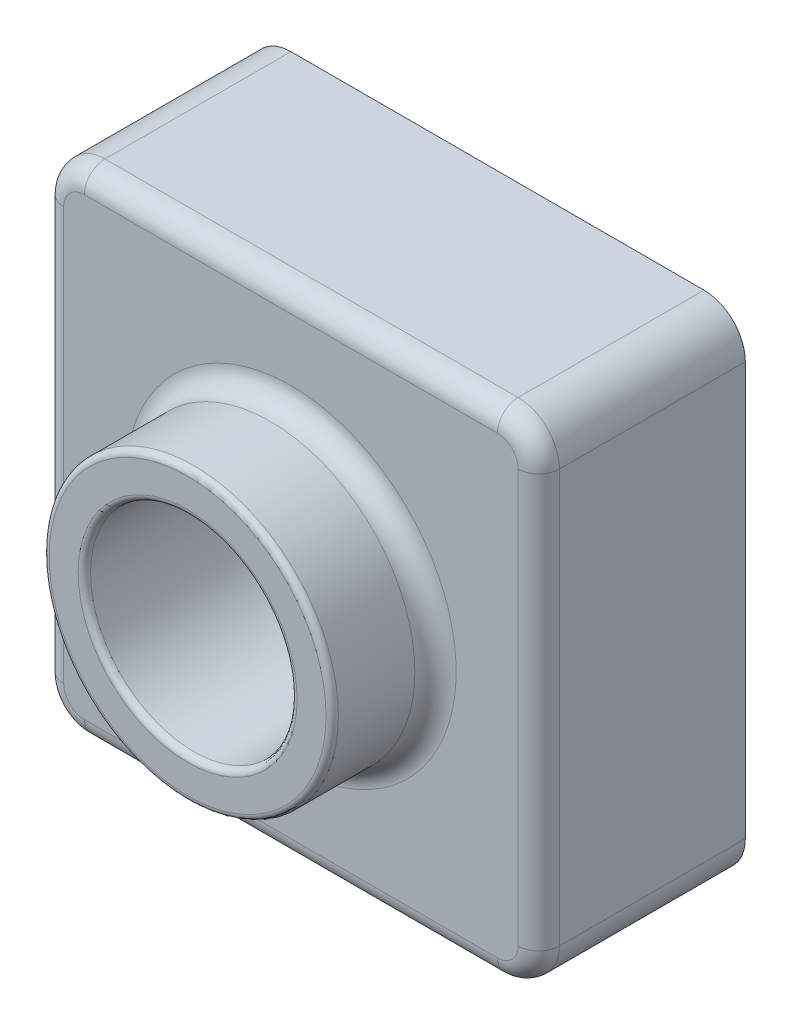
ISO-10303-21;
HEADER;
FILE_DESCRIPTION(('STEP AP214'),'2;1');
FILE_NAME('part.step','',(''),(''),'','','');
FILE_SCHEMA(('AUTOMOTIVE_DESIGN { 1 0 10303 214 1 1 1 1 }'));
ENDSEC;
DATA;
#1=APPLICATION_CONTEXT('core data for automotive mechanical design processes');
#2=APPLICATION_PROTOCOL_DEFINITION('international standard','automotive_design',2000,#1);
#3=PRODUCT_CONTEXT('',#1,'mechanical');
#4=PRODUCT('Part','Part','',(#3));
#5=PRODUCT_RELATED_PRODUCT_CATEGORY('part','',(#4));
#6=PRODUCT_DEFINITION_FORMATION('','',#4);
#7=PRODUCT_DEFINITION_CONTEXT('part definition',#1,'design');
#8=PRODUCT_DEFINITION('design','',#6,#7);
#9=PRODUCT_DEFINITION_SHAPE('','',#8);
#10=(LENGTH_UNIT() NAMED_UNIT(*) SI_UNIT(.MILLI.,.METRE.));
#11=(NAMED_UNIT(*) PLANE_ANGLE_UNIT() SI_UNIT($,.RADIAN.));
#12=(NAMED_UNIT(*) SI_UNIT($,.STERADIAN.) SOLID_ANGLE_UNIT());
#13=UNCERTAINTY_MEASURE_WITH_UNIT(LENGTH_MEASURE(1.E-05),#10,'distance_accuracy_value','');
#14=(GEOMETRIC_REPRESENTATION_CONTEXT(3) GLOBAL_UNCERTAINTY_ASSIGNED_CONTEXT((#13)) GLOBAL_UNIT_ASSIGNED_CONTEXT((#10,
#11,#12)) REPRESENTATION_CONTEXT('',''));
#15=CARTESIAN_POINT('',(0.,0.,0.));
#16=DIRECTION('',(0.,0.,1.));
#17=DIRECTION('',(1.,0.,0.));
#18=AXIS2_PLACEMENT_3D('',#15,#16,#17);
#19=CARTESIAN_POINT('',(0.,0.,0.));
#20=DIRECTION('',(0.,0.,-1.));
#21=DIRECTION('',(-1.,0.,0.));
#22=AXIS2_PLACEMENT_3D('',#19,#20,#21);
#23=PLANE('',#22);
#24=DIRECTION('',(1.,0.,0.));
#25=VECTOR('',#24,1.);
#26=CARTESIAN_POINT('',(0.,0.,0.));
#27=LINE('',#26,#25);
#28=CARTESIAN_POINT('',(10.,0.,0.));
#29=VERTEX_POINT('',#28);
#30=CARTESIAN_POINT('',(110.,0.,0.));
#31=VERTEX_POINT('',#30);
#32=EDGE_CURVE('E299',#29,#31,#27,.T.);
#33=ORIENTED_EDGE('',*,*,#32,.F.);
#34=CARTESIAN_POINT('',(10.,10.,0.));
#35=DIRECTION('',(0.,0.,-1.));
#36=DIRECTION('',(-1.,0.,0.));
#37=AXIS2_PLACEMENT_3D('',#34,#35,#36);
#38=CIRCLE('',#37,10.);
#39=CARTESIAN_POINT('',(0.,10.,0.));
#40=VERTEX_POINT('',#39);
#41=EDGE_CURVE('E326',#29,#40,#38,.T.);
#42=ORIENTED_EDGE('',*,*,#41,.T.);
#43=DIRECTION('',(0.,-1.,0.));
#44=VECTOR('',#43,1.);
#45=CARTESIAN_POINT('',(0.,0.,0.));
#46=LINE('',#45,#44);
#47=CARTESIAN_POINT('',(0.,110.,0.));
#48=VERTEX_POINT('',#47);
#49=EDGE_CURVE('E295',#48,#40,#46,.T.);
#50=ORIENTED_EDGE('',*,*,#49,.F.);
#51=CARTESIAN_POINT('',(9.99999999999996,110.,0.));
#52=DIRECTION('',(0.,0.,-1.));
#53=DIRECTION('',(-1.,0.,0.));
#54=AXIS2_PLACEMENT_3D('',#51,#52,#53);
#55=CIRCLE('',#54,10.);
#56=CARTESIAN_POINT('',(9.99999999999996,120.,0.));
#57=VERTEX_POINT('',#56);
#58=EDGE_CURVE('E323',#48,#57,#55,.T.);
#59=ORIENTED_EDGE('',*,*,#58,.T.);
#60=DIRECTION('',(-1.,0.,0.));
#61=VECTOR('',#60,1.);
#62=CARTESIAN_POINT('',(0.,120.,0.));
#63=LINE('',#62,#61);
#64=CARTESIAN_POINT('',(110.,120.,0.));
#65=VERTEX_POINT('',#64);
#66=EDGE_CURVE('E307',#65,#57,#63,.T.);
#67=ORIENTED_EDGE('',*,*,#66,.F.);
#68=CARTESIAN_POINT('',(110.,110.,0.));
#69=DIRECTION('',(0.,0.,-1.));
#70=DIRECTION('',(-1.,0.,0.));
#71=AXIS2_PLACEMENT_3D('',#68,#69,#70);
#72=CIRCLE('',#71,10.);
#73=CARTESIAN_POINT('',(120.,110.,0.));
#74=VERTEX_POINT('',#73);
#75=EDGE_CURVE('E317',#65,#74,#72,.T.);
#76=ORIENTED_EDGE('',*,*,#75,.T.);
#77=DIRECTION('',(0.,1.,0.));
#78=VECTOR('',#77,1.);
#79=CARTESIAN_POINT('',(120.,0.,0.));
#80=LINE('',#79,#78);
#81=CARTESIAN_POINT('',(120.,10.,0.));
#82=VERTEX_POINT('',#81);
#83=EDGE_CURVE('E303',#82,#74,#80,.T.);
#84=ORIENTED_EDGE('',*,*,#83,.F.);
#85=CARTESIAN_POINT('',(110.,10.,0.));
#86=DIRECTION('',(0.,0.,-1.));
#87=DIRECTION('',(-1.,0.,0.));
#88=AXIS2_PLACEMENT_3D('',#85,#86,#87);
#89=CIRCLE('',#88,10.);
#90=EDGE_CURVE('E320',#82,#31,#89,.T.);
#91=ORIENTED_EDGE('',*,*,#90,.T.);
#92=EDGE_LOOP('',(#33,#42,#50,#59,#67,#76,#84,#91));
#93=FACE_BOUND('',#92,.T.);
#94=CARTESIAN_POINT('',(10.,10.,0.));
#95=DIRECTION('',(0.,0.,-1.));
#96=DIRECTION('',(-1.,0.,0.));
#97=AXIS2_PLACEMENT_3D('',#94,#95,#96);
#98=CIRCLE('',#97,8.);
#99=CARTESIAN_POINT('',(10.,2.,0.));
#100=VERTEX_POINT('',#99);
#101=CARTESIAN_POINT('',(2.,10.,0.));
#102=VERTEX_POINT('',#101);
#103=EDGE_CURVE('E189',#100,#102,#98,.T.);
#104=ORIENTED_EDGE('',*,*,#103,.F.);
#105=DIRECTION('',(1.,0.,0.));
#106=VECTOR('',#105,1.);
#107=CARTESIAN_POINT('',(0.,2.,0.));
#108=LINE('',#107,#106);
#109=CARTESIAN_POINT('',(110.,2.,0.));
#110=VERTEX_POINT('',#109);
#111=EDGE_CURVE('E268',#100,#110,#108,.T.);
#112=ORIENTED_EDGE('',*,*,#111,.T.);
#113=CARTESIAN_POINT('',(110.,10.,0.));
#114=DIRECTION('',(0.,0.,-1.));
#115=DIRECTION('',(-1.,0.,0.));
#116=AXIS2_PLACEMENT_3D('',#113,#114,#115);
#117=CIRCLE('',#116,8.);
#118=CARTESIAN_POINT('',(118.,10.,0.));
#119=VERTEX_POINT('',#118);
#120=EDGE_CURVE('E272',#119,#110,#117,.T.);
#121=ORIENTED_EDGE('',*,*,#120,.F.);
#122=DIRECTION('',(0.,1.,0.));
#123=VECTOR('',#122,1.);
#124=CARTESIAN_POINT('',(118.,0.,0.));
#125=LINE('',#124,#123);
#126=CARTESIAN_POINT('',(118.,110.,0.));
#127=VERTEX_POINT('',#126);
#128=EDGE_CURVE('E276',#119,#127,#125,.T.);
#129=ORIENTED_EDGE('',*,*,#128,.T.);
#130=CARTESIAN_POINT('',(110.,110.,0.));
#131=DIRECTION('',(0.,0.,-1.));
#132=DIRECTION('',(-1.,0.,0.));
#133=AXIS2_PLACEMENT_3D('',#130,#131,#132);
#134=CIRCLE('',#133,8.);
#135=CARTESIAN_POINT('',(110.,118.,0.));
#136=VERTEX_POINT('',#135);
#137=EDGE_CURVE('E242',#136,#127,#134,.T.);
#138=ORIENTED_EDGE('',*,*,#137,.F.);
#139=DIRECTION('',(-1.,0.,0.));
#140=VECTOR('',#139,1.);
#141=CARTESIAN_POINT('',(0.,118.,0.));
#142=LINE('',#141,#140);
#143=CARTESIAN_POINT('',(9.99999999999996,118.,0.));
#144=VERTEX_POINT('',#143);
#145=EDGE_CURVE('E205',#136,#144,#142,.T.);
#146=ORIENTED_EDGE('',*,*,#145,.T.);
#147=CARTESIAN_POINT('',(9.99999999999996,110.,0.));
#148=DIRECTION('',(0.,0.,-1.));
#149=DIRECTION('',(-1.,0.,0.));
#150=AXIS2_PLACEMENT_3D('',#147,#148,#149);
#151=CIRCLE('',#150,8.);
#152=CARTESIAN_POINT('',(1.99999999999996,110.,0.));
#153=VERTEX_POINT('',#152);
#154=EDGE_CURVE('E269',#153,#144,#151,.T.);
#155=ORIENTED_EDGE('',*,*,#154,.F.);
#156=DIRECTION('',(0.,-1.,0.));
#157=VECTOR('',#156,1.);
#158=CARTESIAN_POINT('',(2.,0.,0.));
#159=LINE('',#158,#157);
#160=EDGE_CURVE('E260',#153,#102,#159,.T.);
#161=ORIENTED_EDGE('',*,*,#160,.T.);
#162=EDGE_LOOP('',(#104,#112,#121,#129,#138,#146,#155,#161));
#163=FACE_BOUND('',#162,.T.);
#164=ADVANCED_FACE('F41',(#93,#163),#23,.T.);
#165=CARTESIAN_POINT('',(0.,0.,50.));
#166=DIRECTION('',(1.,0.,0.));
#167=DIRECTION('',(0.,1.,0.));
#168=AXIS2_PLACEMENT_3D('',#165,#166,#167);
#169=PLANE('',#168);
#170=DIRECTION('',(0.,0.,-1.));
#171=VECTOR('',#170,1.);
#172=CARTESIAN_POINT('',(0.,10.,50.));
#173=LINE('',#172,#171);
#174=CARTESIAN_POINT('',(0.,10.,45.));
#175=VERTEX_POINT('',#174);
#176=EDGE_CURVE('E332',#40,#175,#173,.F.);
#177=ORIENTED_EDGE('',*,*,#176,.T.);
#178=DIRECTION('',(0.,-1.,0.));
#179=VECTOR('',#178,1.);
#180=CARTESIAN_POINT('',(0.,0.,45.));
#181=LINE('',#180,#179);
#182=CARTESIAN_POINT('',(0.,110.,45.));
#183=VERTEX_POINT('',#182);
#184=EDGE_CURVE('E51',#175,#183,#181,.F.);
#185=ORIENTED_EDGE('',*,*,#184,.T.);
#186=DIRECTION('',(0.,0.,-1.));
#187=VECTOR('',#186,1.);
#188=CARTESIAN_POINT('',(0.,110.,50.));
#189=LINE('',#188,#187);
#190=EDGE_CURVE('E329',#183,#48,#189,.T.);
#191=ORIENTED_EDGE('',*,*,#190,.T.);
#192=ORIENTED_EDGE('',*,*,#49,.T.);
#193=EDGE_LOOP('',(#177,#185,#191,#192));
#194=FACE_BOUND('',#193,.T.);
#195=ADVANCED_FACE('F502',(#194),#169,.F.);
#196=CARTESIAN_POINT('',(0.,0.,50.));
#197=DIRECTION('',(0.,1.,0.));
#198=DIRECTION('',(0.,0.,1.));
#199=AXIS2_PLACEMENT_3D('',#196,#197,#198);
#200=PLANE('',#199);
#201=DIRECTION('',(0.,0.,-1.));
#202=VECTOR('',#201,1.);
#203=CARTESIAN_POINT('',(110.,0.,50.));
#204=LINE('',#203,#202);
#205=CARTESIAN_POINT('',(110.,0.,45.));
#206=VERTEX_POINT('',#205);
#207=EDGE_CURVE('E311',#31,#206,#204,.F.);
#208=ORIENTED_EDGE('',*,*,#207,.T.);
#209=DIRECTION('',(1.,0.,0.));
#210=VECTOR('',#209,1.);
#211=CARTESIAN_POINT('',(0.,0.,45.));
#212=LINE('',#211,#210);
#213=CARTESIAN_POINT('',(10.,0.,45.));
#214=VERTEX_POINT('',#213);
#215=EDGE_CURVE('E67',#206,#214,#212,.F.);
#216=ORIENTED_EDGE('',*,*,#215,.T.);
#217=DIRECTION('',(0.,0.,-1.));
#218=VECTOR('',#217,1.);
#219=CARTESIAN_POINT('',(10.,0.,50.));
#220=LINE('',#219,#218);
#221=EDGE_CURVE('E314',#214,#29,#220,.T.);
#222=ORIENTED_EDGE('',*,*,#221,.T.);
#223=ORIENTED_EDGE('',*,*,#32,.T.);
#224=EDGE_LOOP('',(#208,#216,#222,#223));
#225=FACE_BOUND('',#224,.T.);
#226=ADVANCED_FACE('F460',(#225),#200,.F.);
#227=CARTESIAN_POINT('',(120.,0.,50.));
#228=DIRECTION('',(-1.,0.,0.));
#229=DIRECTION('',(0.,-1.,0.));
#230=AXIS2_PLACEMENT_3D('',#227,#228,#229);
#231=PLANE('',#230);
#232=DIRECTION('',(0.,0.,-1.));
#233=VECTOR('',#232,1.);
#234=CARTESIAN_POINT('',(120.,110.,50.));
#235=LINE('',#234,#233);
#236=CARTESIAN_POINT('',(120.,110.,45.));
#237=VERTEX_POINT('',#236);
#238=EDGE_CURVE('E342',#74,#237,#235,.F.);
#239=ORIENTED_EDGE('',*,*,#238,.T.);
#240=DIRECTION('',(0.,1.,0.));
#241=VECTOR('',#240,1.);
#242=CARTESIAN_POINT('',(120.,0.,45.));
#243=LINE('',#242,#241);
#244=CARTESIAN_POINT('',(120.,10.,45.));
#245=VERTEX_POINT('',#244);
#246=EDGE_CURVE('E404',#237,#245,#243,.F.);
#247=ORIENTED_EDGE('',*,*,#246,.T.);
#248=DIRECTION('',(0.,0.,-1.));
#249=VECTOR('',#248,1.);
#250=CARTESIAN_POINT('',(120.,10.,50.));
#251=LINE('',#250,#249);
#252=EDGE_CURVE('E346',#245,#82,#251,.T.);
#253=ORIENTED_EDGE('',*,*,#252,.T.);
#254=ORIENTED_EDGE('',*,*,#83,.T.);
#255=EDGE_LOOP('',(#239,#247,#253,#254));
#256=FACE_BOUND('',#255,.T.);
#257=ADVANCED_FACE('F471',(#256),#231,.F.);
#258=CARTESIAN_POINT('',(0.,120.,50.));
#259=DIRECTION('',(0.,-1.,0.));
#260=DIRECTION('',(0.,0.,-1.));
#261=AXIS2_PLACEMENT_3D('',#258,#259,#260);
#262=PLANE('',#261);
#263=DIRECTION('',(0.,0.,-1.));
#264=VECTOR('',#263,1.);
#265=CARTESIAN_POINT('',(9.99999999999996,120.,50.));
#266=LINE('',#265,#264);
#267=CARTESIAN_POINT('',(9.99999999999996,120.,45.));
#268=VERTEX_POINT('',#267);
#269=EDGE_CURVE('E338',#57,#268,#266,.F.);
#270=ORIENTED_EDGE('',*,*,#269,.T.);
#271=DIRECTION('',(-1.,0.,0.));
#272=VECTOR('',#271,1.);
#273=CARTESIAN_POINT('',(0.,120.,45.));
#274=LINE('',#273,#272);
#275=CARTESIAN_POINT('',(110.,120.,45.));
#276=VERTEX_POINT('',#275);
#277=EDGE_CURVE('E398',#268,#276,#274,.F.);
#278=ORIENTED_EDGE('',*,*,#277,.T.);
#279=DIRECTION('',(0.,0.,-1.));
#280=VECTOR('',#279,1.);
#281=CARTESIAN_POINT('',(110.,120.,50.));
#282=LINE('',#281,#280);
#283=EDGE_CURVE('E335',#276,#65,#282,.T.);
#284=ORIENTED_EDGE('',*,*,#283,.T.);
#285=ORIENTED_EDGE('',*,*,#66,.T.);
#286=EDGE_LOOP('',(#270,#278,#284,#285));
#287=FACE_BOUND('',#286,.T.);
#288=ADVANCED_FACE('F538',(#287),#262,.F.);
#289=CARTESIAN_POINT('',(0.,0.,50.));
#290=DIRECTION('',(0.,0.,-1.));
#291=DIRECTION('',(-1.,0.,0.));
#292=AXIS2_PLACEMENT_3D('',#289,#290,#291);
#293=PLANE('',#292);
#294=DIRECTION('',(-1.,0.,0.));
#295=VECTOR('',#294,1.);
#296=CARTESIAN_POINT('',(0.,115.,50.));
#297=LINE('',#296,#295);
#298=CARTESIAN_POINT('',(110.,115.,50.));
#299=VERTEX_POINT('',#298);
#300=CARTESIAN_POINT('',(9.99999999999996,115.,50.));
#301=VERTEX_POINT('',#300);
#302=EDGE_CURVE('E387',#299,#301,#297,.T.);
#303=ORIENTED_EDGE('',*,*,#302,.T.);
#304=CARTESIAN_POINT('',(9.99999999999996,110.,50.));
#305=DIRECTION('',(0.,0.,-1.));
#306=DIRECTION('',(-1.,0.,0.));
#307=AXIS2_PLACEMENT_3D('',#304,#305,#306);
#308=CIRCLE('',#307,5.);
#309=CARTESIAN_POINT('',(4.99999999999996,110.,50.));
#310=VERTEX_POINT('',#309);
#311=EDGE_CURVE('E390',#301,#310,#308,.F.);
#312=ORIENTED_EDGE('',*,*,#311,.T.);
#313=DIRECTION('',(0.,-1.,0.));
#314=VECTOR('',#313,1.);
#315=CARTESIAN_POINT('',(5.,0.,50.));
#316=LINE('',#315,#314);
#317=CARTESIAN_POINT('',(5.,10.,50.));
#318=VERTEX_POINT('',#317);
#319=EDGE_CURVE('E369',#310,#318,#316,.T.);
#320=ORIENTED_EDGE('',*,*,#319,.T.);
#321=CARTESIAN_POINT('',(10.,10.,50.));
#322=DIRECTION('',(0.,0.,-1.));
#323=DIRECTION('',(-1.,0.,0.));
#324=AXIS2_PLACEMENT_3D('',#321,#322,#323);
#325=CIRCLE('',#324,5.);
#326=CARTESIAN_POINT('',(10.,5.,50.));
#327=VERTEX_POINT('',#326);
#328=EDGE_CURVE('E372',#318,#327,#325,.F.);
#329=ORIENTED_EDGE('',*,*,#328,.T.);
#330=DIRECTION('',(1.,0.,0.));
#331=VECTOR('',#330,1.);
#332=CARTESIAN_POINT('',(0.,5.,50.));
#333=LINE('',#332,#331);
#334=CARTESIAN_POINT('',(110.,5.,50.));
#335=VERTEX_POINT('',#334);
#336=EDGE_CURVE('E375',#327,#335,#333,.T.);
#337=ORIENTED_EDGE('',*,*,#336,.T.);
#338=CARTESIAN_POINT('',(110.,10.,50.));
#339=DIRECTION('',(0.,0.,-1.));
#340=DIRECTION('',(-1.,0.,0.));
#341=AXIS2_PLACEMENT_3D('',#338,#339,#340);
#342=CIRCLE('',#341,5.);
#343=CARTESIAN_POINT('',(115.,10.,50.));
#344=VERTEX_POINT('',#343);
#345=EDGE_CURVE('E378',#335,#344,#342,.F.);
#346=ORIENTED_EDGE('',*,*,#345,.T.);
#347=DIRECTION('',(0.,1.,0.));
#348=VECTOR('',#347,1.);
#349=CARTESIAN_POINT('',(115.,0.,50.));
#350=LINE('',#349,#348);
#351=CARTESIAN_POINT('',(115.,110.,50.));
#352=VERTEX_POINT('',#351);
#353=EDGE_CURVE('E381',#344,#352,#350,.T.);
#354=ORIENTED_EDGE('',*,*,#353,.T.);
#355=CARTESIAN_POINT('',(110.,110.,50.));
#356=DIRECTION('',(0.,0.,-1.));
#357=DIRECTION('',(-1.,0.,0.));
#358=AXIS2_PLACEMENT_3D('',#355,#356,#357);
#359=CIRCLE('',#358,5.);
#360=EDGE_CURVE('E384',#352,#299,#359,.F.);
#361=ORIENTED_EDGE('',*,*,#360,.T.);
#362=EDGE_LOOP('',(#303,#312,#320,#329,#337,#346,#354,#361));
#363=FACE_BOUND('',#362,.T.);
#364=CARTESIAN_POINT('',(60.,60.,50.));
#365=DIRECTION('',(0.,0.,-1.));
#366=DIRECTION('',(-1.,0.,0.));
#367=AXIS2_PLACEMENT_3D('',#364,#365,#366);
#368=CIRCLE('',#367,40.);
#369=CARTESIAN_POINT('',(20.,60.,50.));
#370=VERTEX_POINT('',#369);
#371=EDGE_CURVE('E365',#370,#370,#368,.T.);
#372=ORIENTED_EDGE('',*,*,#371,.T.);
#373=EDGE_LOOP('',(#372));
#374=FACE_BOUND('',#373,.T.);
#375=ADVANCED_FACE('F487',(#363,#374),#293,.F.);
#376=CARTESIAN_POINT('',(60.,60.,0.));
#377=DIRECTION('',(0.,0.,-1.));
#378=DIRECTION('',(-1.,0.,0.));
#379=AXIS2_PLACEMENT_3D('',#376,#377,#378);
#380=CIRCLE('',#379,27.);
#381=CARTESIAN_POINT('',(33.,60.,0.));
#382=VERTEX_POINT('',#381);
#383=EDGE_CURVE('E261',#382,#382,#380,.F.);
#384=ORIENTED_EDGE('',*,*,#383,.F.);
#385=EDGE_LOOP('',(#384));
#386=FACE_BOUND('',#385,.T.);
#387=CARTESIAN_POINT('',(60.,60.,0.));
#388=DIRECTION('',(0.,0.,1.));
#389=DIRECTION('',(1.,0.,0.));
#390=AXIS2_PLACEMENT_3D('',#387,#388,#389);
#391=CIRCLE('',#390,25.);
#392=CARTESIAN_POINT('',(85.,60.,0.));
#393=VERTEX_POINT('',#392);
#394=EDGE_CURVE('E250',#393,#393,#391,.T.);
#395=ORIENTED_EDGE('',*,*,#394,.T.);
#396=EDGE_LOOP('',(#395));
#397=FACE_BOUND('',#396,.T.);
#398=ADVANCED_FACE('F521',(#386,#397),#23,.T.);
#399=CARTESIAN_POINT('',(60.,60.,75.));
#400=DIRECTION('',(0.,0.,-1.));
#401=DIRECTION('',(-1.,0.,0.));
#402=AXIS2_PLACEMENT_3D('',#399,#400,#401);
#403=CYLINDRICAL_SURFACE('',#402,35.);
#404=CARTESIAN_POINT('',(60.,60.,55.));
#405=DIRECTION('',(0.,0.,-1.));
#406=DIRECTION('',(-1.,0.,0.));
#407=AXIS2_PLACEMENT_3D('',#404,#405,#406);
#408=CIRCLE('',#407,35.);
#409=CARTESIAN_POINT('',(25.,60.,55.));
#410=VERTEX_POINT('',#409);
#411=EDGE_CURVE('E11',#410,#410,#408,.F.);
#412=ORIENTED_EDGE('',*,*,#411,.T.);
#413=EDGE_LOOP('',(#412));
#414=FACE_BOUND('',#413,.T.);
#415=CARTESIAN_POINT('',(60.,60.,73.5));
#416=DIRECTION('',(0.,0.,1.));
#417=DIRECTION('',(1.,0.,0.));
#418=AXIS2_PLACEMENT_3D('',#415,#416,#417);
#419=CIRCLE('',#418,35.);
#420=CARTESIAN_POINT('',(95.,60.,73.5));
#421=VERTEX_POINT('',#420);
#422=EDGE_CURVE('E361',#421,#421,#419,.F.);
#423=ORIENTED_EDGE('',*,*,#422,.T.);
#424=EDGE_LOOP('',(#423));
#425=FACE_BOUND('',#424,.T.);
#426=ADVANCED_FACE('F529',(#414,#425),#403,.T.);
#427=CARTESIAN_POINT('',(60.,60.,75.));
#428=DIRECTION('',(0.,0.,1.));
#429=DIRECTION('',(1.,0.,0.));
#430=AXIS2_PLACEMENT_3D('',#427,#428,#429);
#431=PLANE('',#430);
#432=CARTESIAN_POINT('',(60.,60.,75.));
#433=DIRECTION('',(0.,0.,1.));
#434=DIRECTION('',(1.,0.,0.));
#435=AXIS2_PLACEMENT_3D('',#432,#433,#434);
#436=CIRCLE('',#435,26.5);
#437=CARTESIAN_POINT('',(86.5,60.,75.));
#438=VERTEX_POINT('',#437);
#439=EDGE_CURVE('E357',#438,#438,#436,.F.);
#440=ORIENTED_EDGE('',*,*,#439,.T.);
#441=EDGE_LOOP('',(#440));
#442=FACE_BOUND('',#441,.T.);
#443=CARTESIAN_POINT('',(60.,60.,75.));
#444=DIRECTION('',(0.,0.,1.));
#445=DIRECTION('',(1.,0.,0.));
#446=AXIS2_PLACEMENT_3D('',#443,#444,#445);
#447=CIRCLE('',#446,33.5);
#448=CARTESIAN_POINT('',(93.5,60.,75.));
#449=VERTEX_POINT('',#448);
#450=EDGE_CURVE('E353',#449,#449,#447,.T.);
#451=ORIENTED_EDGE('',*,*,#450,.T.);
#452=EDGE_LOOP('',(#451));
#453=FACE_BOUND('',#452,.T.);
#454=ADVANCED_FACE('F535',(#442,#453),#431,.T.);
#455=CARTESIAN_POINT('',(60.,60.,0.));
#456=DIRECTION('',(0.,0.,1.));
#457=DIRECTION('',(1.,0.,0.));
#458=AXIS2_PLACEMENT_3D('',#455,#456,#457);
#459=CYLINDRICAL_SURFACE('',#458,25.);
#460=CARTESIAN_POINT('',(60.,60.,73.5));
#461=DIRECTION('',(0.,0.,1.));
#462=DIRECTION('',(1.,0.,0.));
#463=AXIS2_PLACEMENT_3D('',#460,#461,#462);
#464=CIRCLE('',#463,25.);
#465=CARTESIAN_POINT('',(85.,60.,73.5));
#466=VERTEX_POINT('',#465);
#467=EDGE_CURVE('E349',#466,#466,#464,.T.);
#468=ORIENTED_EDGE('',*,*,#467,.T.);
#469=EDGE_LOOP('',(#468));
#470=FACE_BOUND('',#469,.T.);
#471=ORIENTED_EDGE('',*,*,#394,.F.);
#472=EDGE_LOOP('',(#471));
#473=FACE_BOUND('',#472,.T.);
#474=ADVANCED_FACE('F543',(#470,#473),#459,.F.);
#475=CARTESIAN_POINT('',(10.,10.,50.));
#476=DIRECTION('',(0.,0.,-1.));
#477=DIRECTION('',(-1.,0.,0.));
#478=AXIS2_PLACEMENT_3D('',#475,#476,#477);
#479=CYLINDRICAL_SURFACE('',#478,10.);
#480=ORIENTED_EDGE('',*,*,#221,.F.);
#481=CARTESIAN_POINT('',(10.,10.,45.));
#482=DIRECTION('',(0.,0.,-1.));
#483=DIRECTION('',(-1.,0.,0.));
#484=AXIS2_PLACEMENT_3D('',#481,#482,#483);
#485=CIRCLE('',#484,10.);
#486=EDGE_CURVE('E59',#214,#175,#485,.T.);
#487=ORIENTED_EDGE('',*,*,#486,.T.);
#488=ORIENTED_EDGE('',*,*,#176,.F.);
#489=ORIENTED_EDGE('',*,*,#41,.F.);
#490=EDGE_LOOP('',(#480,#487,#488,#489));
#491=FACE_BOUND('',#490,.T.);
#492=ADVANCED_FACE('F545',(#491),#479,.T.);
#493=CARTESIAN_POINT('',(9.99999999999996,110.,50.));
#494=DIRECTION('',(0.,0.,-1.));
#495=DIRECTION('',(-1.,0.,0.));
#496=AXIS2_PLACEMENT_3D('',#493,#494,#495);
#497=CYLINDRICAL_SURFACE('',#496,10.);
#498=ORIENTED_EDGE('',*,*,#190,.F.);
#499=CARTESIAN_POINT('',(9.99999999999996,110.,45.));
#500=DIRECTION('',(0.,0.,-1.));
#501=DIRECTION('',(-1.,0.,0.));
#502=AXIS2_PLACEMENT_3D('',#499,#500,#501);
#503=CIRCLE('',#502,10.);
#504=EDGE_CURVE('E394',#183,#268,#503,.T.);
#505=ORIENTED_EDGE('',*,*,#504,.T.);
#506=ORIENTED_EDGE('',*,*,#269,.F.);
#507=ORIENTED_EDGE('',*,*,#58,.F.);
#508=EDGE_LOOP('',(#498,#505,#506,#507));
#509=FACE_BOUND('',#508,.T.);
#510=ADVANCED_FACE('F506',(#509),#497,.T.);
#511=CARTESIAN_POINT('',(110.,10.,50.));
#512=DIRECTION('',(0.,0.,-1.));
#513=DIRECTION('',(-1.,0.,0.));
#514=AXIS2_PLACEMENT_3D('',#511,#512,#513);
#515=CYLINDRICAL_SURFACE('',#514,10.);
#516=ORIENTED_EDGE('',*,*,#252,.F.);
#517=CARTESIAN_POINT('',(110.,10.,45.));
#518=DIRECTION('',(0.,0.,-1.));
#519=DIRECTION('',(-1.,0.,0.));
#520=AXIS2_PLACEMENT_3D('',#517,#518,#519);
#521=CIRCLE('',#520,10.);
#522=EDGE_CURVE('E407',#245,#206,#521,.T.);
#523=ORIENTED_EDGE('',*,*,#522,.T.);
#524=ORIENTED_EDGE('',*,*,#207,.F.);
#525=ORIENTED_EDGE('',*,*,#90,.F.);
#526=EDGE_LOOP('',(#516,#523,#524,#525));
#527=FACE_BOUND('',#526,.T.);
#528=ADVANCED_FACE('F458',(#527),#515,.T.);
#529=CARTESIAN_POINT('',(110.,110.,50.));
#530=DIRECTION('',(0.,0.,-1.));
#531=DIRECTION('',(-1.,0.,0.));
#532=AXIS2_PLACEMENT_3D('',#529,#530,#531);
#533=CYLINDRICAL_SURFACE('',#532,10.);
#534=ORIENTED_EDGE('',*,*,#283,.F.);
#535=CARTESIAN_POINT('',(110.,110.,45.));
#536=DIRECTION('',(0.,0.,-1.));
#537=DIRECTION('',(-1.,0.,0.));
#538=AXIS2_PLACEMENT_3D('',#535,#536,#537);
#539=CIRCLE('',#538,10.);
#540=EDGE_CURVE('E401',#276,#237,#539,.T.);
#541=ORIENTED_EDGE('',*,*,#540,.T.);
#542=ORIENTED_EDGE('',*,*,#238,.F.);
#543=ORIENTED_EDGE('',*,*,#75,.F.);
#544=EDGE_LOOP('',(#534,#541,#542,#543));
#545=FACE_BOUND('',#544,.T.);
#546=ADVANCED_FACE('F474',(#545),#533,.T.);
#547=CARTESIAN_POINT('',(2.,0.,50.));
#548=DIRECTION('',(1.,0.,0.));
#549=DIRECTION('',(0.,1.,0.));
#550=AXIS2_PLACEMENT_3D('',#547,#548,#549);
#551=PLANE('',#550);
#552=ORIENTED_EDGE('',*,*,#160,.F.);
#553=DIRECTION('',(0.,0.,1.));
#554=VECTOR('',#553,1.);
#555=CARTESIAN_POINT('',(1.99999999999996,110.,50.));
#556=LINE('',#555,#554);
#557=CARTESIAN_POINT('',(1.99999999999996,110.,48.));
#558=VERTEX_POINT('',#557);
#559=EDGE_CURVE('E195',#558,#153,#556,.F.);
#560=ORIENTED_EDGE('',*,*,#559,.F.);
#561=DIRECTION('',(0.,-1.,0.));
#562=VECTOR('',#561,1.);
#563=CARTESIAN_POINT('',(2.,0.,48.));
#564=LINE('',#563,#562);
#565=CARTESIAN_POINT('',(2.,10.,48.));
#566=VERTEX_POINT('',#565);
#567=EDGE_CURVE('E199',#558,#566,#564,.T.);
#568=ORIENTED_EDGE('',*,*,#567,.T.);
#569=DIRECTION('',(0.,0.,1.));
#570=VECTOR('',#569,1.);
#571=CARTESIAN_POINT('',(2.,10.,50.));
#572=LINE('',#571,#570);
#573=EDGE_CURVE('E182',#102,#566,#572,.T.);
#574=ORIENTED_EDGE('',*,*,#573,.F.);
#575=EDGE_LOOP('',(#552,#560,#568,#574));
#576=FACE_BOUND('',#575,.T.);
#577=ADVANCED_FACE('F200',(#576),#551,.T.);
#578=CARTESIAN_POINT('',(0.,2.,50.));
#579=DIRECTION('',(0.,1.,0.));
#580=DIRECTION('',(0.,0.,1.));
#581=AXIS2_PLACEMENT_3D('',#578,#579,#580);
#582=PLANE('',#581);
#583=DIRECTION('',(1.,0.,0.));
#584=VECTOR('',#583,1.);
#585=CARTESIAN_POINT('',(0.,2.,48.));
#586=LINE('',#585,#584);
#587=CARTESIAN_POINT('',(10.,2.,48.));
#588=VERTEX_POINT('',#587);
#589=CARTESIAN_POINT('',(110.,2.,48.));
#590=VERTEX_POINT('',#589);
#591=EDGE_CURVE('E204',#588,#590,#586,.T.);
#592=ORIENTED_EDGE('',*,*,#591,.T.);
#593=DIRECTION('',(0.,0.,1.));
#594=VECTOR('',#593,1.);
#595=CARTESIAN_POINT('',(110.,2.,50.));
#596=LINE('',#595,#594);
#597=EDGE_CURVE('E243',#110,#590,#596,.T.);
#598=ORIENTED_EDGE('',*,*,#597,.F.);
#599=ORIENTED_EDGE('',*,*,#111,.F.);
#600=DIRECTION('',(0.,0.,1.));
#601=VECTOR('',#600,1.);
#602=CARTESIAN_POINT('',(10.,2.,50.));
#603=LINE('',#602,#601);
#604=EDGE_CURVE('E239',#588,#100,#603,.F.);
#605=ORIENTED_EDGE('',*,*,#604,.F.);
#606=EDGE_LOOP('',(#592,#598,#599,#605));
#607=FACE_BOUND('',#606,.T.);
#608=ADVANCED_FACE('F593',(#607),#582,.T.);
#609=CARTESIAN_POINT('',(118.,0.,50.));
#610=DIRECTION('',(-1.,0.,0.));
#611=DIRECTION('',(0.,-1.,0.));
#612=AXIS2_PLACEMENT_3D('',#609,#610,#611);
#613=PLANE('',#612);
#614=DIRECTION('',(0.,1.,0.));
#615=VECTOR('',#614,1.);
#616=CARTESIAN_POINT('',(118.,0.,48.));
#617=LINE('',#616,#615);
#618=CARTESIAN_POINT('',(118.,10.,48.));
#619=VERTEX_POINT('',#618);
#620=CARTESIAN_POINT('',(118.,110.,48.));
#621=VERTEX_POINT('',#620);
#622=EDGE_CURVE('E227',#619,#621,#617,.T.);
#623=ORIENTED_EDGE('',*,*,#622,.T.);
#624=DIRECTION('',(0.,0.,1.));
#625=VECTOR('',#624,1.);
#626=CARTESIAN_POINT('',(118.,110.,50.));
#627=LINE('',#626,#625);
#628=EDGE_CURVE('E251',#127,#621,#627,.T.);
#629=ORIENTED_EDGE('',*,*,#628,.F.);
#630=ORIENTED_EDGE('',*,*,#128,.F.);
#631=DIRECTION('',(0.,0.,1.));
#632=VECTOR('',#631,1.);
#633=CARTESIAN_POINT('',(118.,10.,50.));
#634=LINE('',#633,#632);
#635=EDGE_CURVE('E246',#619,#119,#634,.F.);
#636=ORIENTED_EDGE('',*,*,#635,.F.);
#637=EDGE_LOOP('',(#623,#629,#630,#636));
#638=FACE_BOUND('',#637,.T.);
#639=ADVANCED_FACE('F589',(#638),#613,.T.);
#640=CARTESIAN_POINT('',(0.,118.,50.));
#641=DIRECTION('',(0.,-1.,0.));
#642=DIRECTION('',(0.,0.,-1.));
#643=AXIS2_PLACEMENT_3D('',#640,#641,#642);
#644=PLANE('',#643);
#645=ORIENTED_EDGE('',*,*,#145,.F.);
#646=DIRECTION('',(0.,0.,-1.));
#647=VECTOR('',#646,1.);
#648=CARTESIAN_POINT('',(110.,118.,50.));
#649=LINE('',#648,#647);
#650=CARTESIAN_POINT('',(110.,118.,48.));
#651=VERTEX_POINT('',#650);
#652=EDGE_CURVE('E212',#651,#136,#649,.T.);
#653=ORIENTED_EDGE('',*,*,#652,.F.);
#654=DIRECTION('',(-1.,0.,0.));
#655=VECTOR('',#654,1.);
#656=CARTESIAN_POINT('',(0.,118.,48.));
#657=LINE('',#656,#655);
#658=CARTESIAN_POINT('',(9.99999999999996,118.,48.));
#659=VERTEX_POINT('',#658);
#660=EDGE_CURVE('E233',#651,#659,#657,.T.);
#661=ORIENTED_EDGE('',*,*,#660,.T.);
#662=DIRECTION('',(0.,0.,-1.));
#663=VECTOR('',#662,1.);
#664=CARTESIAN_POINT('',(9.99999999999996,118.,50.));
#665=LINE('',#664,#663);
#666=EDGE_CURVE('E217',#144,#659,#665,.F.);
#667=ORIENTED_EDGE('',*,*,#666,.F.);
#668=EDGE_LOOP('',(#645,#653,#661,#667));
#669=FACE_BOUND('',#668,.T.);
#670=ADVANCED_FACE('F585',(#669),#644,.T.);
#671=CARTESIAN_POINT('',(0.,0.,48.));
#672=DIRECTION('',(0.,0.,-1.));
#673=DIRECTION('',(-1.,0.,0.));
#674=AXIS2_PLACEMENT_3D('',#671,#672,#673);
#675=PLANE('',#674);
#676=CARTESIAN_POINT('',(60.,60.,48.));
#677=DIRECTION('',(0.,0.,-1.));
#678=DIRECTION('',(-1.,0.,0.));
#679=AXIS2_PLACEMENT_3D('',#676,#677,#678);
#680=CIRCLE('',#679,33.);
#681=CARTESIAN_POINT('',(27.,60.,48.));
#682=VERTEX_POINT('',#681);
#683=EDGE_CURVE('E223',#682,#682,#680,.F.);
#684=ORIENTED_EDGE('',*,*,#683,.T.);
#685=EDGE_LOOP('',(#684));
#686=FACE_BOUND('',#685,.T.);
#687=ORIENTED_EDGE('',*,*,#567,.F.);
#688=CARTESIAN_POINT('',(9.99999999999996,110.,48.));
#689=DIRECTION('',(0.,0.,-1.));
#690=DIRECTION('',(-1.,0.,0.));
#691=AXIS2_PLACEMENT_3D('',#688,#689,#690);
#692=CIRCLE('',#691,8.);
#693=EDGE_CURVE('E213',#659,#558,#692,.F.);
#694=ORIENTED_EDGE('',*,*,#693,.F.);
#695=ORIENTED_EDGE('',*,*,#660,.F.);
#696=CARTESIAN_POINT('',(110.,110.,48.));
#697=DIRECTION('',(0.,0.,-1.));
#698=DIRECTION('',(-1.,0.,0.));
#699=AXIS2_PLACEMENT_3D('',#696,#697,#698);
#700=CIRCLE('',#699,8.);
#701=EDGE_CURVE('E194',#621,#651,#700,.F.);
#702=ORIENTED_EDGE('',*,*,#701,.F.);
#703=ORIENTED_EDGE('',*,*,#622,.F.);
#704=CARTESIAN_POINT('',(110.,10.,48.));
#705=DIRECTION('',(0.,0.,-1.));
#706=DIRECTION('',(-1.,0.,0.));
#707=AXIS2_PLACEMENT_3D('',#704,#705,#706);
#708=CIRCLE('',#707,8.);
#709=EDGE_CURVE('E219',#590,#619,#708,.F.);
#710=ORIENTED_EDGE('',*,*,#709,.F.);
#711=ORIENTED_EDGE('',*,*,#591,.F.);
#712=CARTESIAN_POINT('',(10.,10.,48.));
#713=DIRECTION('',(0.,0.,-1.));
#714=DIRECTION('',(-1.,0.,0.));
#715=AXIS2_PLACEMENT_3D('',#712,#713,#714);
#716=CIRCLE('',#715,8.);
#717=EDGE_CURVE('E186',#566,#588,#716,.F.);
#718=ORIENTED_EDGE('',*,*,#717,.F.);
#719=EDGE_LOOP('',(#687,#694,#695,#702,#703,#710,#711,#718));
#720=FACE_BOUND('',#719,.T.);
#721=ADVANCED_FACE('F207',(#686,#720),#675,.T.);
#722=CARTESIAN_POINT('',(60.,60.,75.));
#723=DIRECTION('',(0.,0.,-1.));
#724=DIRECTION('',(-1.,0.,0.));
#725=AXIS2_PLACEMENT_3D('',#722,#723,#724);
#726=CYLINDRICAL_SURFACE('',#725,33.);
#727=CARTESIAN_POINT('',(60.,60.,73.));
#728=DIRECTION('',(0.,0.,1.));
#729=DIRECTION('',(1.,0.,0.));
#730=AXIS2_PLACEMENT_3D('',#727,#728,#729);
#731=CIRCLE('',#730,33.);
#732=CARTESIAN_POINT('',(93.,60.,73.));
#733=VERTEX_POINT('',#732);
#734=EDGE_CURVE('E256',#733,#733,#731,.T.);
#735=ORIENTED_EDGE('',*,*,#734,.T.);
#736=EDGE_LOOP('',(#735));
#737=FACE_BOUND('',#736,.T.);
#738=ORIENTED_EDGE('',*,*,#683,.F.);
#739=EDGE_LOOP('',(#738));
#740=FACE_BOUND('',#739,.T.);
#741=ADVANCED_FACE('F578',(#737,#740),#726,.F.);
#742=CARTESIAN_POINT('',(60.,60.,73.));
#743=DIRECTION('',(0.,0.,1.));
#744=DIRECTION('',(1.,0.,0.));
#745=AXIS2_PLACEMENT_3D('',#742,#743,#744);
#746=PLANE('',#745);
#747=CARTESIAN_POINT('',(60.,60.,73.));
#748=DIRECTION('',(0.,0.,1.));
#749=DIRECTION('',(1.,0.,0.));
#750=AXIS2_PLACEMENT_3D('',#747,#748,#749);
#751=CIRCLE('',#750,27.);
#752=CARTESIAN_POINT('',(87.,60.,73.));
#753=VERTEX_POINT('',#752);
#754=EDGE_CURVE('E262',#753,#753,#751,.T.);
#755=ORIENTED_EDGE('',*,*,#754,.T.);
#756=EDGE_LOOP('',(#755));
#757=FACE_BOUND('',#756,.T.);
#758=ORIENTED_EDGE('',*,*,#734,.F.);
#759=EDGE_LOOP('',(#758));
#760=FACE_BOUND('',#759,.T.);
#761=ADVANCED_FACE('F574',(#757,#760),#746,.F.);
#762=CARTESIAN_POINT('',(60.,60.,0.));
#763=DIRECTION('',(0.,0.,1.));
#764=DIRECTION('',(1.,0.,0.));
#765=AXIS2_PLACEMENT_3D('',#762,#763,#764);
#766=CYLINDRICAL_SURFACE('',#765,27.);
#767=ORIENTED_EDGE('',*,*,#383,.T.);
#768=EDGE_LOOP('',(#767));
#769=FACE_BOUND('',#768,.T.);
#770=ORIENTED_EDGE('',*,*,#754,.F.);
#771=EDGE_LOOP('',(#770));
#772=FACE_BOUND('',#771,.T.);
#773=ADVANCED_FACE('F571',(#769,#772),#766,.T.);
#774=CARTESIAN_POINT('',(10.,10.,50.));
#775=DIRECTION('',(0.,0.,-1.));
#776=DIRECTION('',(-1.,0.,0.));
#777=AXIS2_PLACEMENT_3D('',#774,#775,#776);
#778=CYLINDRICAL_SURFACE('',#777,8.);
#779=ORIENTED_EDGE('',*,*,#717,.T.);
#780=ORIENTED_EDGE('',*,*,#604,.T.);
#781=ORIENTED_EDGE('',*,*,#103,.T.);
#782=ORIENTED_EDGE('',*,*,#573,.T.);
#783=EDGE_LOOP('',(#779,#780,#781,#782));
#784=FACE_BOUND('',#783,.T.);
#785=ADVANCED_FACE('F184',(#784),#778,.F.);
#786=CARTESIAN_POINT('',(9.99999999999996,110.,50.));
#787=DIRECTION('',(0.,0.,-1.));
#788=DIRECTION('',(-1.,0.,0.));
#789=AXIS2_PLACEMENT_3D('',#786,#787,#788);
#790=CYLINDRICAL_SURFACE('',#789,8.);
#791=ORIENTED_EDGE('',*,*,#693,.T.);
#792=ORIENTED_EDGE('',*,*,#559,.T.);
#793=ORIENTED_EDGE('',*,*,#154,.T.);
#794=ORIENTED_EDGE('',*,*,#666,.T.);
#795=EDGE_LOOP('',(#791,#792,#793,#794));
#796=FACE_BOUND('',#795,.T.);
#797=ADVANCED_FACE('F564',(#796),#790,.F.);
#798=CARTESIAN_POINT('',(110.,10.,50.));
#799=DIRECTION('',(0.,0.,-1.));
#800=DIRECTION('',(-1.,0.,0.));
#801=AXIS2_PLACEMENT_3D('',#798,#799,#800);
#802=CYLINDRICAL_SURFACE('',#801,8.);
#803=ORIENTED_EDGE('',*,*,#709,.T.);
#804=ORIENTED_EDGE('',*,*,#635,.T.);
#805=ORIENTED_EDGE('',*,*,#120,.T.);
#806=ORIENTED_EDGE('',*,*,#597,.T.);
#807=EDGE_LOOP('',(#803,#804,#805,#806));
#808=FACE_BOUND('',#807,.T.);
#809=ADVANCED_FACE('F560',(#808),#802,.F.);
#810=CARTESIAN_POINT('',(110.,110.,50.));
#811=DIRECTION('',(0.,0.,-1.));
#812=DIRECTION('',(-1.,0.,0.));
#813=AXIS2_PLACEMENT_3D('',#810,#811,#812);
#814=CYLINDRICAL_SURFACE('',#813,8.);
#815=ORIENTED_EDGE('',*,*,#701,.T.);
#816=ORIENTED_EDGE('',*,*,#652,.T.);
#817=ORIENTED_EDGE('',*,*,#137,.T.);
#818=ORIENTED_EDGE('',*,*,#628,.T.);
#819=EDGE_LOOP('',(#815,#816,#817,#818));
#820=FACE_BOUND('',#819,.T.);
#821=ADVANCED_FACE('F556',(#820),#814,.F.);
#822=CARTESIAN_POINT('',(60.,60.,73.5));
#823=DIRECTION('',(0.,0.,1.));
#824=DIRECTION('',(1.,0.,0.));
#825=AXIS2_PLACEMENT_3D('',#822,#823,#824);
#826=TOROIDAL_SURFACE('',#825,26.5,1.5);
#827=ORIENTED_EDGE('',*,*,#439,.F.);
#828=EDGE_LOOP('',(#827));
#829=FACE_BOUND('',#828,.T.);
#830=ORIENTED_EDGE('',*,*,#467,.F.);
#831=EDGE_LOOP('',(#830));
#832=FACE_BOUND('',#831,.T.);
#833=ADVANCED_FACE('F559',(#829,#832),#826,.T.);
#834=CARTESIAN_POINT('',(60.,60.,73.5));
#835=DIRECTION('',(0.,0.,1.));
#836=DIRECTION('',(1.,0.,0.));
#837=AXIS2_PLACEMENT_3D('',#834,#835,#836);
#838=TOROIDAL_SURFACE('',#837,33.5,1.5);
#839=ORIENTED_EDGE('',*,*,#422,.F.);
#840=EDGE_LOOP('',(#839));
#841=FACE_BOUND('',#840,.T.);
#842=ORIENTED_EDGE('',*,*,#450,.F.);
#843=EDGE_LOOP('',(#842));
#844=FACE_BOUND('',#843,.T.);
#845=ADVANCED_FACE('F610',(#841,#844),#838,.T.);
#846=CARTESIAN_POINT('',(110.,10.,45.));
#847=DIRECTION('',(0.,0.,-1.));
#848=DIRECTION('',(-1.,0.,0.));
#849=AXIS2_PLACEMENT_3D('',#846,#847,#848);
#850=DEGENERATE_TOROIDAL_SURFACE('',#849,5.,5.,.T.);
#851=CARTESIAN_POINT('',(110.,5.,45.));
#852=DIRECTION('',(-1.,0.,0.));
#853=DIRECTION('',(0.,0.,1.));
#854=AXIS2_PLACEMENT_3D('',#851,#852,#853);
#855=CIRCLE('',#854,5.);
#856=EDGE_CURVE('E437',#206,#335,#855,.T.);
#857=ORIENTED_EDGE('',*,*,#856,.F.);
#858=ORIENTED_EDGE('',*,*,#522,.F.);
#859=CARTESIAN_POINT('',(115.,10.,45.));
#860=DIRECTION('',(0.,1.,0.));
#861=DIRECTION('',(-1.,0.,0.));
#862=AXIS2_PLACEMENT_3D('',#859,#860,#861);
#863=CIRCLE('',#862,5.);
#864=EDGE_CURVE('E45',#344,#245,#863,.T.);
#865=ORIENTED_EDGE('',*,*,#864,.F.);
#866=ORIENTED_EDGE('',*,*,#345,.F.);
#867=EDGE_LOOP('',(#857,#858,#865,#866));
#868=FACE_BOUND('',#867,.T.);
#869=ADVANCED_FACE('F454',(#868),#850,.T.);
#870=CARTESIAN_POINT('',(115.,0.,45.));
#871=DIRECTION('',(0.,1.,0.));
#872=DIRECTION('',(-1.,0.,0.));
#873=AXIS2_PLACEMENT_3D('',#870,#871,#872);
#874=CYLINDRICAL_SURFACE('',#873,5.);
#875=ORIENTED_EDGE('',*,*,#864,.T.);
#876=ORIENTED_EDGE('',*,*,#246,.F.);
#877=CARTESIAN_POINT('',(115.,110.,45.));
#878=DIRECTION('',(0.,1.,0.));
#879=DIRECTION('',(0.,0.,1.));
#880=AXIS2_PLACEMENT_3D('',#877,#878,#879);
#881=CIRCLE('',#880,5.);
#882=EDGE_CURVE('E434',#352,#237,#881,.T.);
#883=ORIENTED_EDGE('',*,*,#882,.F.);
#884=ORIENTED_EDGE('',*,*,#353,.F.);
#885=EDGE_LOOP('',(#875,#876,#883,#884));
#886=FACE_BOUND('',#885,.T.);
#887=ADVANCED_FACE('F449',(#886),#874,.T.);
#888=CARTESIAN_POINT('',(0.,5.,45.));
#889=DIRECTION('',(1.,0.,0.));
#890=DIRECTION('',(0.,0.,-1.));
#891=AXIS2_PLACEMENT_3D('',#888,#889,#890);
#892=CYLINDRICAL_SURFACE('',#891,5.);
#893=ORIENTED_EDGE('',*,*,#856,.T.);
#894=ORIENTED_EDGE('',*,*,#336,.F.);
#895=CARTESIAN_POINT('',(10.,5.,45.));
#896=DIRECTION('',(-1.,0.,0.));
#897=DIRECTION('',(0.,0.,1.));
#898=AXIS2_PLACEMENT_3D('',#895,#896,#897);
#899=CIRCLE('',#898,5.);
#900=EDGE_CURVE('E430',#214,#327,#899,.T.);
#901=ORIENTED_EDGE('',*,*,#900,.F.);
#902=ORIENTED_EDGE('',*,*,#215,.F.);
#903=EDGE_LOOP('',(#893,#894,#901,#902));
#904=FACE_BOUND('',#903,.T.);
#905=ADVANCED_FACE('F491',(#904),#892,.T.);
#906=CARTESIAN_POINT('',(110.,110.,45.));
#907=DIRECTION('',(0.,0.,-1.));
#908=DIRECTION('',(-1.,0.,0.));
#909=AXIS2_PLACEMENT_3D('',#906,#907,#908);
#910=DEGENERATE_TOROIDAL_SURFACE('',#909,5.,5.,.T.);
#911=ORIENTED_EDGE('',*,*,#882,.T.);
#912=ORIENTED_EDGE('',*,*,#540,.F.);
#913=CARTESIAN_POINT('',(110.,115.,45.));
#914=DIRECTION('',(-1.,0.,0.));
#915=DIRECTION('',(0.,0.,1.));
#916=AXIS2_PLACEMENT_3D('',#913,#914,#915);
#917=CIRCLE('',#916,5.);
#918=EDGE_CURVE('E426',#299,#276,#917,.T.);
#919=ORIENTED_EDGE('',*,*,#918,.F.);
#920=ORIENTED_EDGE('',*,*,#360,.F.);
#921=EDGE_LOOP('',(#911,#912,#919,#920));
#922=FACE_BOUND('',#921,.T.);
#923=ADVANCED_FACE('F478',(#922),#910,.T.);
#924=CARTESIAN_POINT('',(10.,10.,45.));
#925=DIRECTION('',(0.,0.,-1.));
#926=DIRECTION('',(-1.,0.,0.));
#927=AXIS2_PLACEMENT_3D('',#924,#925,#926);
#928=DEGENERATE_TOROIDAL_SURFACE('',#927,5.,5.,.T.);
#929=ORIENTED_EDGE('',*,*,#900,.T.);
#930=ORIENTED_EDGE('',*,*,#328,.F.);
#931=CARTESIAN_POINT('',(5.,10.,45.));
#932=DIRECTION('',(0.,1.,0.));
#933=DIRECTION('',(-1.,0.,0.));
#934=AXIS2_PLACEMENT_3D('',#931,#932,#933);
#935=CIRCLE('',#934,5.);
#936=EDGE_CURVE('E422',#175,#318,#935,.T.);
#937=ORIENTED_EDGE('',*,*,#936,.F.);
#938=ORIENTED_EDGE('',*,*,#486,.F.);
#939=EDGE_LOOP('',(#929,#930,#937,#938));
#940=FACE_BOUND('',#939,.T.);
#941=ADVANCED_FACE('F493',(#940),#928,.T.);
#942=CARTESIAN_POINT('',(0.,115.,45.));
#943=DIRECTION('',(-1.,0.,0.));
#944=DIRECTION('',(0.,0.,1.));
#945=AXIS2_PLACEMENT_3D('',#942,#943,#944);
#946=CYLINDRICAL_SURFACE('',#945,5.);
#947=ORIENTED_EDGE('',*,*,#918,.T.);
#948=ORIENTED_EDGE('',*,*,#277,.F.);
#949=CARTESIAN_POINT('',(9.99999999999996,115.,45.));
#950=DIRECTION('',(-1.,0.,0.));
#951=DIRECTION('',(0.,0.,1.));
#952=AXIS2_PLACEMENT_3D('',#949,#950,#951);
#953=CIRCLE('',#952,5.);
#954=EDGE_CURVE('E419',#301,#268,#953,.T.);
#955=ORIENTED_EDGE('',*,*,#954,.F.);
#956=ORIENTED_EDGE('',*,*,#302,.F.);
#957=EDGE_LOOP('',(#947,#948,#955,#956));
#958=FACE_BOUND('',#957,.T.);
#959=ADVANCED_FACE('F483',(#958),#946,.T.);
#960=CARTESIAN_POINT('',(5.,0.,45.));
#961=DIRECTION('',(0.,-1.,0.));
#962=DIRECTION('',(1.,0.,0.));
#963=AXIS2_PLACEMENT_3D('',#960,#961,#962);
#964=CYLINDRICAL_SURFACE('',#963,5.);
#965=ORIENTED_EDGE('',*,*,#936,.T.);
#966=ORIENTED_EDGE('',*,*,#319,.F.);
#967=CARTESIAN_POINT('',(4.99999999999996,110.,45.));
#968=DIRECTION('',(0.,1.,0.));
#969=DIRECTION('',(0.,0.,1.));
#970=AXIS2_PLACEMENT_3D('',#967,#968,#969);
#971=CIRCLE('',#970,5.);
#972=EDGE_CURVE('E416',#183,#310,#971,.T.);
#973=ORIENTED_EDGE('',*,*,#972,.F.);
#974=ORIENTED_EDGE('',*,*,#184,.F.);
#975=EDGE_LOOP('',(#965,#966,#973,#974));
#976=FACE_BOUND('',#975,.T.);
#977=ADVANCED_FACE('F499',(#976),#964,.T.);
#978=CARTESIAN_POINT('',(9.99999999999996,110.,45.));
#979=DIRECTION('',(0.,0.,-1.));
#980=DIRECTION('',(-1.,0.,0.));
#981=AXIS2_PLACEMENT_3D('',#978,#979,#980);
#982=DEGENERATE_TOROIDAL_SURFACE('',#981,5.,5.,.T.);
#983=ORIENTED_EDGE('',*,*,#954,.T.);
#984=ORIENTED_EDGE('',*,*,#504,.F.);
#985=ORIENTED_EDGE('',*,*,#972,.T.);
#986=ORIENTED_EDGE('',*,*,#311,.F.);
#987=EDGE_LOOP('',(#983,#984,#985,#986));
#988=FACE_BOUND('',#987,.T.);
#989=ADVANCED_FACE('F509',(#988),#982,.T.);
#990=CARTESIAN_POINT('',(60.,60.,55.));
#991=DIRECTION('',(0.,0.,-1.));
#992=DIRECTION('',(-1.,0.,0.));
#993=AXIS2_PLACEMENT_3D('',#990,#991,#992);
#994=TOROIDAL_SURFACE('',#993,40.,5.);
#995=ORIENTED_EDGE('',*,*,#371,.F.);
#996=EDGE_LOOP('',(#995));
#997=FACE_BOUND('',#996,.T.);
#998=ORIENTED_EDGE('',*,*,#411,.F.);
#999=EDGE_LOOP('',(#998));
#1000=FACE_BOUND('',#999,.T.);
#1001=ADVANCED_FACE('F43',(#997,#1000),#994,.F.);
#1002=CLOSED_SHELL('',(#164,#195,#226,#257,#288,#375,#398,#426,#454,#474,#492,#510,#528,#546,
#577,#608,#639,#670,#721,#741,#761,#773,#785,#797,#809,#821,#833,#845,#869,#887,#905,#923,#941,
#959,#977,#989,#1001));
#1003=MANIFOLD_SOLID_BREP('B2',#1002);
#1004=ADVANCED_BREP_SHAPE_REPRESENTATION('',(#18,#1003),#14);
#1005=SHAPE_DEFINITION_REPRESENTATION(#9,#1004);
ENDSEC;
END-ISO-10303-21;
